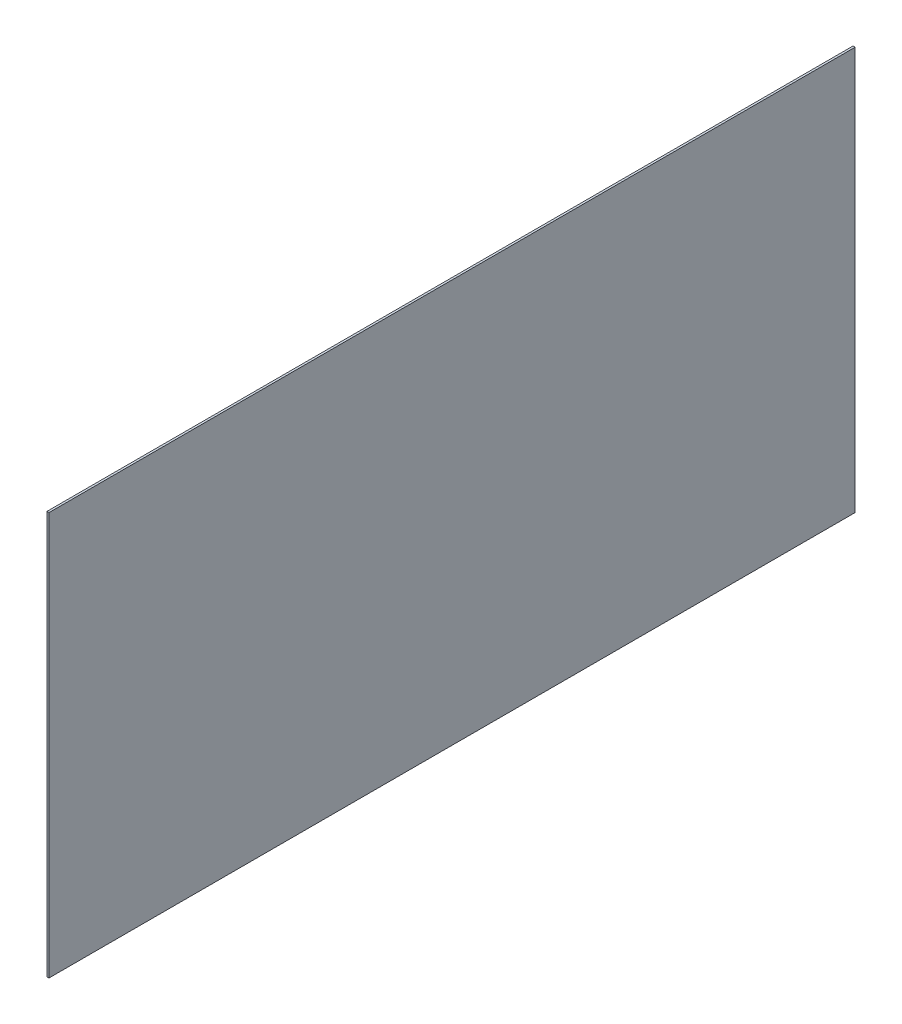
ISO-10303-21;
HEADER;
FILE_DESCRIPTION(('STEP AP214'),'2;1');
FILE_NAME('part.step','',(''),(''),'','','');
FILE_SCHEMA(('AUTOMOTIVE_DESIGN { 1 0 10303 214 1 1 1 1 }'));
ENDSEC;
DATA;
#1=APPLICATION_CONTEXT('core data for automotive mechanical design processes');
#2=APPLICATION_PROTOCOL_DEFINITION('international standard','automotive_design',2000,#1);
#3=PRODUCT_CONTEXT('',#1,'mechanical');
#4=PRODUCT('Part','Part','',(#3));
#5=PRODUCT_RELATED_PRODUCT_CATEGORY('part','',(#4));
#6=PRODUCT_DEFINITION_FORMATION('','',#4);
#7=PRODUCT_DEFINITION_CONTEXT('part definition',#1,'design');
#8=PRODUCT_DEFINITION('design','',#6,#7);
#9=PRODUCT_DEFINITION_SHAPE('','',#8);
#10=(LENGTH_UNIT() NAMED_UNIT(*) SI_UNIT(.MILLI.,.METRE.));
#11=(NAMED_UNIT(*) PLANE_ANGLE_UNIT() SI_UNIT($,.RADIAN.));
#12=(NAMED_UNIT(*) SI_UNIT($,.STERADIAN.) SOLID_ANGLE_UNIT());
#13=UNCERTAINTY_MEASURE_WITH_UNIT(LENGTH_MEASURE(1.E-05),#10,'distance_accuracy_value','');
#14=(GEOMETRIC_REPRESENTATION_CONTEXT(3) GLOBAL_UNCERTAINTY_ASSIGNED_CONTEXT((#13)) GLOBAL_UNIT_ASSIGNED_CONTEXT((#10,
#11,#12)) REPRESENTATION_CONTEXT('',''));
#15=CARTESIAN_POINT('',(0.,0.,0.));
#16=DIRECTION('',(0.,0.,1.));
#17=DIRECTION('',(1.,0.,0.));
#18=AXIS2_PLACEMENT_3D('',#15,#16,#17);
#19=CARTESIAN_POINT('',(4.7625,0.,0.));
#20=DIRECTION('',(0.,0.,-1.));
#21=DIRECTION('',(-1.,0.,0.));
#22=AXIS2_PLACEMENT_3D('',#19,#20,#21);
#23=PLANE('',#22);
#24=DIRECTION('',(0.,-1.,0.));
#25=VECTOR('',#24,1.);
#26=CARTESIAN_POINT('',(0.,0.,0.));
#27=LINE('',#26,#25);
#28=CARTESIAN_POINT('',(0.,914.4,0.));
#29=VERTEX_POINT('',#28);
#30=CARTESIAN_POINT('',(0.,0.,0.));
#31=VERTEX_POINT('',#30);
#32=EDGE_CURVE('E102',#29,#31,#27,.T.);
#33=ORIENTED_EDGE('',*,*,#32,.T.);
#34=DIRECTION('',(-1.,0.,0.));
#35=VECTOR('',#34,1.);
#36=CARTESIAN_POINT('',(4.7625,0.,0.));
#37=LINE('',#36,#35);
#38=CARTESIAN_POINT('',(4.7625,0.,0.));
#39=VERTEX_POINT('',#38);
#40=EDGE_CURVE('E11',#39,#31,#37,.T.);
#41=ORIENTED_EDGE('',*,*,#40,.F.);
#42=DIRECTION('',(0.,-1.,0.));
#43=VECTOR('',#42,1.);
#44=CARTESIAN_POINT('',(4.7625,0.,0.));
#45=LINE('',#44,#43);
#46=CARTESIAN_POINT('',(4.7625,914.4,0.));
#47=VERTEX_POINT('',#46);
#48=EDGE_CURVE('E90',#47,#39,#45,.T.);
#49=ORIENTED_EDGE('',*,*,#48,.F.);
#50=DIRECTION('',(-1.,0.,0.));
#51=VECTOR('',#50,1.);
#52=CARTESIAN_POINT('',(4.7625,914.4,0.));
#53=LINE('',#52,#51);
#54=EDGE_CURVE('E98',#47,#29,#53,.T.);
#55=ORIENTED_EDGE('',*,*,#54,.T.);
#56=EDGE_LOOP('',(#33,#41,#49,#55));
#57=FACE_BOUND('',#56,.T.);
#58=ADVANCED_FACE('F39',(#57),#23,.F.);
#59=CARTESIAN_POINT('',(4.7625,0.,0.));
#60=DIRECTION('',(0.,1.,0.));
#61=DIRECTION('',(0.,0.,1.));
#62=AXIS2_PLACEMENT_3D('',#59,#60,#61);
#63=PLANE('',#62);
#64=DIRECTION('',(0.,0.,-1.));
#65=VECTOR('',#64,1.);
#66=CARTESIAN_POINT('',(0.,0.,0.));
#67=LINE('',#66,#65);
#68=CARTESIAN_POINT('',(0.,0.,-1828.8));
#69=VERTEX_POINT('',#68);
#70=EDGE_CURVE('E94',#31,#69,#67,.T.);
#71=ORIENTED_EDGE('',*,*,#70,.T.);
#72=DIRECTION('',(-1.,0.,0.));
#73=VECTOR('',#72,1.);
#74=CARTESIAN_POINT('',(4.7625,0.,-1828.8));
#75=LINE('',#74,#73);
#76=CARTESIAN_POINT('',(4.7625,0.,-1828.8));
#77=VERTEX_POINT('',#76);
#78=EDGE_CURVE('E47',#77,#69,#75,.T.);
#79=ORIENTED_EDGE('',*,*,#78,.F.);
#80=DIRECTION('',(0.,0.,-1.));
#81=VECTOR('',#80,1.);
#82=CARTESIAN_POINT('',(4.7625,0.,0.));
#83=LINE('',#82,#81);
#84=EDGE_CURVE('E85',#39,#77,#83,.T.);
#85=ORIENTED_EDGE('',*,*,#84,.F.);
#86=ORIENTED_EDGE('',*,*,#40,.T.);
#87=EDGE_LOOP('',(#71,#79,#85,#86));
#88=FACE_BOUND('',#87,.T.);
#89=ADVANCED_FACE('F93',(#88),#63,.F.);
#90=CARTESIAN_POINT('',(4.7625,0.,-1828.8));
#91=DIRECTION('',(0.,0.,1.));
#92=DIRECTION('',(1.,0.,0.));
#93=AXIS2_PLACEMENT_3D('',#90,#91,#92);
#94=PLANE('',#93);
#95=DIRECTION('',(0.,1.,0.));
#96=VECTOR('',#95,1.);
#97=CARTESIAN_POINT('',(0.,0.,-1828.8));
#98=LINE('',#97,#96);
#99=CARTESIAN_POINT('',(0.,914.4,-1828.8));
#100=VERTEX_POINT('',#99);
#101=EDGE_CURVE('E72',#69,#100,#98,.T.);
#102=ORIENTED_EDGE('',*,*,#101,.T.);
#103=DIRECTION('',(-1.,0.,0.));
#104=VECTOR('',#103,1.);
#105=CARTESIAN_POINT('',(4.7625,914.4,-1828.8));
#106=LINE('',#105,#104);
#107=CARTESIAN_POINT('',(4.7625,914.4,-1828.8));
#108=VERTEX_POINT('',#107);
#109=EDGE_CURVE('E95',#108,#100,#106,.T.);
#110=ORIENTED_EDGE('',*,*,#109,.F.);
#111=DIRECTION('',(0.,1.,0.));
#112=VECTOR('',#111,1.);
#113=CARTESIAN_POINT('',(4.7625,0.,-1828.8));
#114=LINE('',#113,#112);
#115=EDGE_CURVE('E88',#77,#108,#114,.T.);
#116=ORIENTED_EDGE('',*,*,#115,.F.);
#117=ORIENTED_EDGE('',*,*,#78,.T.);
#118=EDGE_LOOP('',(#102,#110,#116,#117));
#119=FACE_BOUND('',#118,.T.);
#120=ADVANCED_FACE('F96',(#119),#94,.F.);
#121=CARTESIAN_POINT('',(4.7625,914.4,0.));
#122=DIRECTION('',(0.,-1.,0.));
#123=DIRECTION('',(0.,0.,-1.));
#124=AXIS2_PLACEMENT_3D('',#121,#122,#123);
#125=PLANE('',#124);
#126=DIRECTION('',(0.,0.,1.));
#127=VECTOR('',#126,1.);
#128=CARTESIAN_POINT('',(0.,914.4,0.));
#129=LINE('',#128,#127);
#130=EDGE_CURVE('E78',#100,#29,#129,.T.);
#131=ORIENTED_EDGE('',*,*,#130,.T.);
#132=ORIENTED_EDGE('',*,*,#54,.F.);
#133=DIRECTION('',(0.,0.,1.));
#134=VECTOR('',#133,1.);
#135=CARTESIAN_POINT('',(4.7625,914.4,0.));
#136=LINE('',#135,#134);
#137=EDGE_CURVE('E55',#108,#47,#136,.T.);
#138=ORIENTED_EDGE('',*,*,#137,.F.);
#139=ORIENTED_EDGE('',*,*,#109,.T.);
#140=EDGE_LOOP('',(#131,#132,#138,#139));
#141=FACE_BOUND('',#140,.T.);
#142=ADVANCED_FACE('F109',(#141),#125,.F.);
#143=CARTESIAN_POINT('',(4.7625,0.,0.));
#144=DIRECTION('',(-1.,0.,0.));
#145=DIRECTION('',(0.,0.,1.));
#146=AXIS2_PLACEMENT_3D('',#143,#144,#145);
#147=PLANE('',#146);
#148=ORIENTED_EDGE('',*,*,#48,.T.);
#149=ORIENTED_EDGE('',*,*,#84,.T.);
#150=ORIENTED_EDGE('',*,*,#115,.T.);
#151=ORIENTED_EDGE('',*,*,#137,.T.);
#152=EDGE_LOOP('',(#148,#149,#150,#151));
#153=FACE_BOUND('',#152,.T.);
#154=ADVANCED_FACE('F86',(#153),#147,.F.);
#155=CARTESIAN_POINT('',(0.,0.,0.));
#156=DIRECTION('',(-1.,0.,0.));
#157=DIRECTION('',(0.,0.,1.));
#158=AXIS2_PLACEMENT_3D('',#155,#156,#157);
#159=PLANE('',#158);
#160=ORIENTED_EDGE('',*,*,#32,.F.);
#161=ORIENTED_EDGE('',*,*,#130,.F.);
#162=ORIENTED_EDGE('',*,*,#101,.F.);
#163=ORIENTED_EDGE('',*,*,#70,.F.);
#164=EDGE_LOOP('',(#160,#161,#162,#163));
#165=FACE_BOUND('',#164,.T.);
#166=ADVANCED_FACE('F112',(#165),#159,.T.);
#167=CLOSED_SHELL('',(#58,#89,#120,#142,#154,#166));
#168=MANIFOLD_SOLID_BREP('B2',#167);
#169=ADVANCED_BREP_SHAPE_REPRESENTATION('',(#18,#168),#14);
#170=SHAPE_DEFINITION_REPRESENTATION(#9,#169);
ENDSEC;
END-ISO-10303-21;
